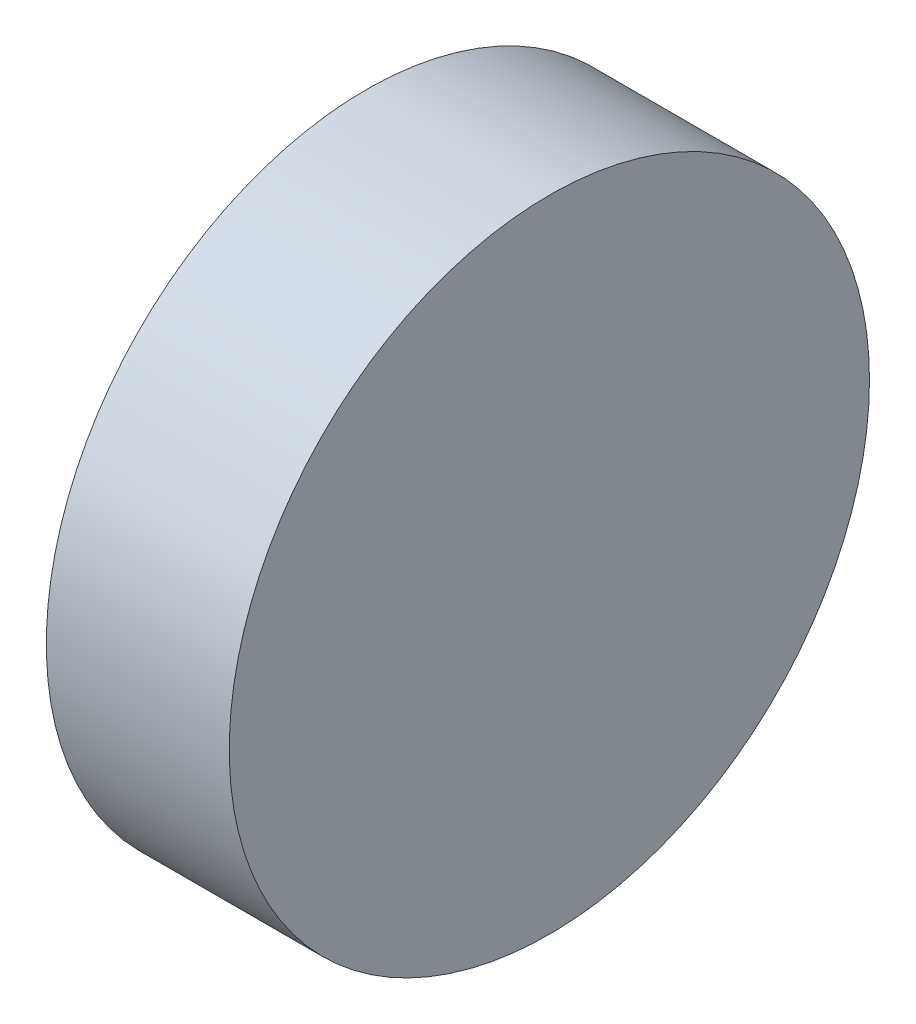
ISO-10303-21;
HEADER;
FILE_DESCRIPTION(('STEP AP214'),'2;1');
FILE_NAME('part.step','',(''),(''),'','','');
FILE_SCHEMA(('AUTOMOTIVE_DESIGN { 1 0 10303 214 1 1 1 1 }'));
ENDSEC;
DATA;
#1=APPLICATION_CONTEXT('core data for automotive mechanical design processes');
#2=APPLICATION_PROTOCOL_DEFINITION('international standard','automotive_design',2000,#1);
#3=PRODUCT_CONTEXT('',#1,'mechanical');
#4=PRODUCT('Part','Part','',(#3));
#5=PRODUCT_RELATED_PRODUCT_CATEGORY('part','',(#4));
#6=PRODUCT_DEFINITION_FORMATION('','',#4);
#7=PRODUCT_DEFINITION_CONTEXT('part definition',#1,'design');
#8=PRODUCT_DEFINITION('design','',#6,#7);
#9=PRODUCT_DEFINITION_SHAPE('','',#8);
#10=(LENGTH_UNIT() NAMED_UNIT(*) SI_UNIT(.MILLI.,.METRE.));
#11=(NAMED_UNIT(*) PLANE_ANGLE_UNIT() SI_UNIT($,.RADIAN.));
#12=(NAMED_UNIT(*) SI_UNIT($,.STERADIAN.) SOLID_ANGLE_UNIT());
#13=UNCERTAINTY_MEASURE_WITH_UNIT(LENGTH_MEASURE(1.E-05),#10,'distance_accuracy_value','');
#14=(GEOMETRIC_REPRESENTATION_CONTEXT(3) GLOBAL_UNCERTAINTY_ASSIGNED_CONTEXT((#13)) GLOBAL_UNIT_ASSIGNED_CONTEXT((#10,
#11,#12)) REPRESENTATION_CONTEXT('',''));
#15=CARTESIAN_POINT('',(0.,0.,0.));
#16=DIRECTION('',(0.,0.,1.));
#17=DIRECTION('',(1.,0.,0.));
#18=AXIS2_PLACEMENT_3D('',#15,#16,#17);
#19=CARTESIAN_POINT('',(1.,0.,0.));
#20=DIRECTION('',(-1.,0.,0.));
#21=DIRECTION('',(0.,0.,1.));
#22=AXIS2_PLACEMENT_3D('',#19,#20,#21);
#23=CYLINDRICAL_SURFACE('',#22,1.75);
#24=CARTESIAN_POINT('',(1.,0.,0.));
#25=DIRECTION('',(1.,0.,0.));
#26=DIRECTION('',(0.,0.,-1.));
#27=AXIS2_PLACEMENT_3D('',#24,#25,#26);
#28=CIRCLE('',#27,1.75);
#29=CARTESIAN_POINT('',(1.,0.,-1.75));
#30=VERTEX_POINT('',#29);
#31=EDGE_CURVE('E10',#30,#30,#28,.T.);
#32=ORIENTED_EDGE('',*,*,#31,.F.);
#33=EDGE_LOOP('',(#32));
#34=FACE_BOUND('',#33,.T.);
#35=CARTESIAN_POINT('',(0.,0.,0.));
#36=DIRECTION('',(1.,0.,0.));
#37=DIRECTION('',(0.,0.,-1.));
#38=AXIS2_PLACEMENT_3D('',#35,#36,#37);
#39=CIRCLE('',#38,1.75);
#40=CARTESIAN_POINT('',(0.,0.,-1.75));
#41=VERTEX_POINT('',#40);
#42=EDGE_CURVE('E34',#41,#41,#39,.T.);
#43=ORIENTED_EDGE('',*,*,#42,.T.);
#44=EDGE_LOOP('',(#43));
#45=FACE_BOUND('',#44,.T.);
#46=ADVANCED_FACE('F31',(#34,#45),#23,.T.);
#47=CARTESIAN_POINT('',(1.,0.,0.));
#48=DIRECTION('',(1.,0.,0.));
#49=DIRECTION('',(0.,0.,-1.));
#50=AXIS2_PLACEMENT_3D('',#47,#48,#49);
#51=PLANE('',#50);
#52=ORIENTED_EDGE('',*,*,#31,.T.);
#53=EDGE_LOOP('',(#52));
#54=FACE_BOUND('',#53,.T.);
#55=ADVANCED_FACE('F46',(#54),#51,.T.);
#56=CARTESIAN_POINT('',(0.,0.,0.));
#57=DIRECTION('',(1.,0.,0.));
#58=DIRECTION('',(0.,0.,-1.));
#59=AXIS2_PLACEMENT_3D('',#56,#57,#58);
#60=PLANE('',#59);
#61=ORIENTED_EDGE('',*,*,#42,.F.);
#62=EDGE_LOOP('',(#61));
#63=FACE_BOUND('',#62,.T.);
#64=ADVANCED_FACE('F44',(#63),#60,.F.);
#65=CLOSED_SHELL('',(#46,#55,#64));
#66=MANIFOLD_SOLID_BREP('B2',#65);
#67=ADVANCED_BREP_SHAPE_REPRESENTATION('',(#18,#66),#14);
#68=SHAPE_DEFINITION_REPRESENTATION(#9,#67);
ENDSEC;
END-ISO-10303-21;
